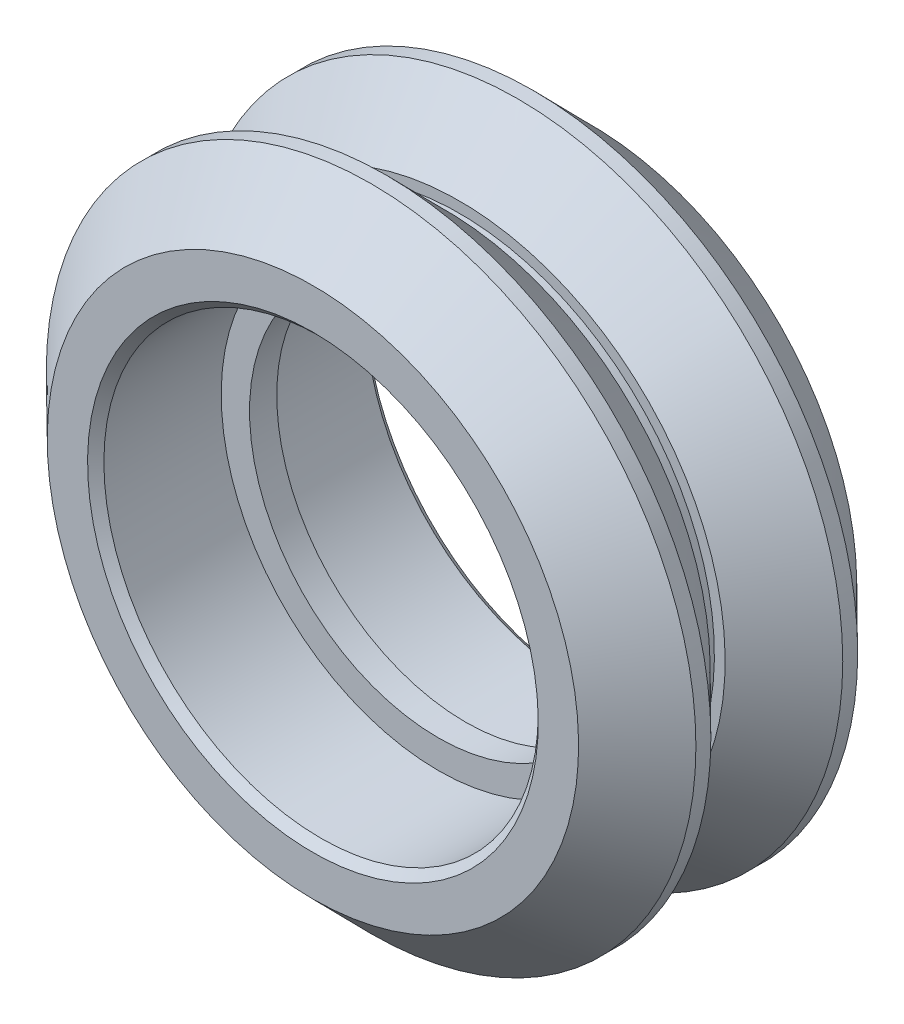
ISO-10303-21;
HEADER;
FILE_DESCRIPTION(('STEP AP214'),'2;1');
FILE_NAME('part.step','',(''),(''),'','','');
FILE_SCHEMA(('AUTOMOTIVE_DESIGN { 1 0 10303 214 1 1 1 1 }'));
ENDSEC;
DATA;
#1=APPLICATION_CONTEXT('core data for automotive mechanical design processes');
#2=APPLICATION_PROTOCOL_DEFINITION('international standard','automotive_design',2000,#1);
#3=PRODUCT_CONTEXT('',#1,'mechanical');
#4=PRODUCT('Part','Part','',(#3));
#5=PRODUCT_RELATED_PRODUCT_CATEGORY('part','',(#4));
#6=PRODUCT_DEFINITION_FORMATION('','',#4);
#7=PRODUCT_DEFINITION_CONTEXT('part definition',#1,'design');
#8=PRODUCT_DEFINITION('design','',#6,#7);
#9=PRODUCT_DEFINITION_SHAPE('','',#8);
#10=(LENGTH_UNIT() NAMED_UNIT(*) SI_UNIT(.MILLI.,.METRE.));
#11=(NAMED_UNIT(*) PLANE_ANGLE_UNIT() SI_UNIT($,.RADIAN.));
#12=(NAMED_UNIT(*) SI_UNIT($,.STERADIAN.) SOLID_ANGLE_UNIT());
#13=UNCERTAINTY_MEASURE_WITH_UNIT(LENGTH_MEASURE(1.E-05),#10,'distance_accuracy_value','');
#14=(GEOMETRIC_REPRESENTATION_CONTEXT(3) GLOBAL_UNCERTAINTY_ASSIGNED_CONTEXT((#13)) GLOBAL_UNIT_ASSIGNED_CONTEXT((#10,
#11,#12)) REPRESENTATION_CONTEXT('',''));
#15=CARTESIAN_POINT('',(0.,0.,0.));
#16=DIRECTION('',(0.,0.,1.));
#17=DIRECTION('',(1.,0.,0.));
#18=AXIS2_PLACEMENT_3D('',#15,#16,#17);
#19=CARTESIAN_POINT('',(0.,0.,5.115));
#20=DIRECTION('',(0.,0.,1.));
#21=DIRECTION('',(0.,-1.,0.));
#22=AXIS2_PLACEMENT_3D('',#19,#20,#21);
#23=CYLINDRICAL_SURFACE('',#22,7.987);
#24=CARTESIAN_POINT('',(0.,0.,4.815));
#25=DIRECTION('',(0.,0.,-1.));
#26=DIRECTION('',(0.,1.,0.));
#27=AXIS2_PLACEMENT_3D('',#24,#25,#26);
#28=CIRCLE('',#27,7.987);
#29=CARTESIAN_POINT('',(0.,7.987,4.815));
#30=VERTEX_POINT('',#29);
#31=EDGE_CURVE('E45',#30,#30,#28,.F.);
#32=ORIENTED_EDGE('',*,*,#31,.T.);
#33=EDGE_LOOP('',(#32));
#34=FACE_BOUND('',#33,.T.);
#35=CARTESIAN_POINT('',(0.,0.,0.499999999999998));
#36=DIRECTION('',(0.,0.,1.));
#37=DIRECTION('',(0.,-1.,0.));
#38=AXIS2_PLACEMENT_3D('',#35,#36,#37);
#39=CIRCLE('',#38,7.987);
#40=CARTESIAN_POINT('',(0.,-7.987,0.499999999999996));
#41=VERTEX_POINT('',#40);
#42=EDGE_CURVE('E89',#41,#41,#39,.T.);
#43=ORIENTED_EDGE('',*,*,#42,.F.);
#44=EDGE_LOOP('',(#43));
#45=FACE_BOUND('',#44,.T.);
#46=ADVANCED_FACE('F30',(#34,#45),#23,.F.);
#47=CARTESIAN_POINT('',(0.,9.77,5.115));
#48=DIRECTION('',(0.,0.,-1.));
#49=DIRECTION('',(0.,1.,0.));
#50=AXIS2_PLACEMENT_3D('',#47,#48,#49);
#51=PLANE('',#50);
#52=CARTESIAN_POINT('',(0.,0.,5.115));
#53=DIRECTION('',(0.,0.,-1.));
#54=DIRECTION('',(0.,1.,0.));
#55=AXIS2_PLACEMENT_3D('',#52,#53,#54);
#56=CIRCLE('',#55,8.287);
#57=CARTESIAN_POINT('',(0.,8.287,5.115));
#58=VERTEX_POINT('',#57);
#59=EDGE_CURVE('E41',#58,#58,#56,.T.);
#60=ORIENTED_EDGE('',*,*,#59,.T.);
#61=EDGE_LOOP('',(#60));
#62=FACE_BOUND('',#61,.T.);
#63=CARTESIAN_POINT('',(0.,0.,5.115));
#64=DIRECTION('',(0.,0.,1.));
#65=DIRECTION('',(0.,-1.,0.));
#66=AXIS2_PLACEMENT_3D('',#63,#64,#65);
#67=CIRCLE('',#66,9.77);
#68=CARTESIAN_POINT('',(0.,-9.77,5.115));
#69=VERTEX_POINT('',#68);
#70=EDGE_CURVE('E50',#69,#69,#67,.T.);
#71=ORIENTED_EDGE('',*,*,#70,.T.);
#72=EDGE_LOOP('',(#71));
#73=FACE_BOUND('',#72,.T.);
#74=ADVANCED_FACE('F96',(#62,#73),#51,.F.);
#75=CARTESIAN_POINT('',(0.,0.,2.975));
#76=DIRECTION('',(0.,0.,-1.));
#77=DIRECTION('',(0.,1.,0.));
#78=AXIS2_PLACEMENT_3D('',#75,#76,#77);
#79=CONICAL_SURFACE('',#78,11.945,0.79350922537995);
#80=ORIENTED_EDGE('',*,*,#70,.F.);
#81=EDGE_LOOP('',(#80));
#82=FACE_BOUND('',#81,.T.);
#83=CARTESIAN_POINT('',(0.,0.,2.975));
#84=DIRECTION('',(0.,0.,1.));
#85=DIRECTION('',(0.,-1.,0.));
#86=AXIS2_PLACEMENT_3D('',#83,#84,#85);
#87=CIRCLE('',#86,11.945);
#88=CARTESIAN_POINT('',(0.,-11.945,2.975));
#89=VERTEX_POINT('',#88);
#90=EDGE_CURVE('E53',#89,#89,#87,.T.);
#91=ORIENTED_EDGE('',*,*,#90,.T.);
#92=EDGE_LOOP('',(#91));
#93=FACE_BOUND('',#92,.T.);
#94=ADVANCED_FACE('F102',(#82,#93),#79,.T.);
#95=CARTESIAN_POINT('',(0.,0.,5.115));
#96=DIRECTION('',(0.,0.,1.));
#97=DIRECTION('',(0.,-1.,0.));
#98=AXIS2_PLACEMENT_3D('',#95,#96,#97);
#99=CYLINDRICAL_SURFACE('',#98,11.945);
#100=ORIENTED_EDGE('',*,*,#90,.F.);
#101=EDGE_LOOP('',(#100));
#102=FACE_BOUND('',#101,.T.);
#103=CARTESIAN_POINT('',(0.,0.,2.425));
#104=DIRECTION('',(0.,0.,1.));
#105=DIRECTION('',(0.,-1.,0.));
#106=AXIS2_PLACEMENT_3D('',#103,#104,#105);
#107=CIRCLE('',#106,11.945);
#108=CARTESIAN_POINT('',(0.,-11.945,2.425));
#109=VERTEX_POINT('',#108);
#110=EDGE_CURVE('E56',#109,#109,#107,.T.);
#111=ORIENTED_EDGE('',*,*,#110,.T.);
#112=EDGE_LOOP('',(#111));
#113=FACE_BOUND('',#112,.T.);
#114=ADVANCED_FACE('F125',(#102,#113),#99,.T.);
#115=CARTESIAN_POINT('',(0.,0.,0.274999999999998));
#116=DIRECTION('',(0.,0.,1.));
#117=DIRECTION('',(0.,-1.,0.));
#118=AXIS2_PLACEMENT_3D('',#115,#116,#117);
#119=CONICAL_SURFACE('',#118,9.77,0.791178445841111);
#120=ORIENTED_EDGE('',*,*,#110,.F.);
#121=EDGE_LOOP('',(#120));
#122=FACE_BOUND('',#121,.T.);
#123=CARTESIAN_POINT('',(0.,0.,0.274999999999998));
#124=DIRECTION('',(0.,0.,1.));
#125=DIRECTION('',(0.,-1.,0.));
#126=AXIS2_PLACEMENT_3D('',#123,#124,#125);
#127=CIRCLE('',#126,9.77);
#128=CARTESIAN_POINT('',(0.,-9.77,0.274999999999997));
#129=VERTEX_POINT('',#128);
#130=EDGE_CURVE('E59',#129,#129,#127,.T.);
#131=ORIENTED_EDGE('',*,*,#130,.T.);
#132=EDGE_LOOP('',(#131));
#133=FACE_BOUND('',#132,.T.);
#134=ADVANCED_FACE('F130',(#122,#133),#119,.T.);
#135=CARTESIAN_POINT('',(0.,9.77,0.275));
#136=DIRECTION('',(0.,0.,1.));
#137=DIRECTION('',(0.,-1.,0.));
#138=AXIS2_PLACEMENT_3D('',#135,#136,#137);
#139=PLANE('',#138);
#140=ORIENTED_EDGE('',*,*,#130,.F.);
#141=EDGE_LOOP('',(#140));
#142=FACE_BOUND('',#141,.T.);
#143=CARTESIAN_POINT('',(0.,0.,0.274999999999998));
#144=DIRECTION('',(0.,0.,1.));
#145=DIRECTION('',(0.,-1.,0.));
#146=AXIS2_PLACEMENT_3D('',#143,#144,#145);
#147=CIRCLE('',#146,9.375);
#148=CARTESIAN_POINT('',(0.,-9.375,0.274999999999997));
#149=VERTEX_POINT('',#148);
#150=EDGE_CURVE('E62',#149,#149,#147,.T.);
#151=ORIENTED_EDGE('',*,*,#150,.T.);
#152=EDGE_LOOP('',(#151));
#153=FACE_BOUND('',#152,.T.);
#154=ADVANCED_FACE('F136',(#142,#153),#139,.F.);
#155=CARTESIAN_POINT('',(0.,0.,5.115));
#156=DIRECTION('',(0.,0.,1.));
#157=DIRECTION('',(0.,-1.,0.));
#158=AXIS2_PLACEMENT_3D('',#155,#156,#157);
#159=CYLINDRICAL_SURFACE('',#158,9.375);
#160=ORIENTED_EDGE('',*,*,#150,.F.);
#161=EDGE_LOOP('',(#160));
#162=FACE_BOUND('',#161,.T.);
#163=CARTESIAN_POINT('',(0.,0.,-0.275000000000002));
#164=DIRECTION('',(0.,0.,1.));
#165=DIRECTION('',(0.,-1.,0.));
#166=AXIS2_PLACEMENT_3D('',#163,#164,#165);
#167=CIRCLE('',#166,9.375);
#168=CARTESIAN_POINT('',(0.,-9.375,-0.275000000000004));
#169=VERTEX_POINT('',#168);
#170=EDGE_CURVE('E65',#169,#169,#167,.T.);
#171=ORIENTED_EDGE('',*,*,#170,.T.);
#172=EDGE_LOOP('',(#171));
#173=FACE_BOUND('',#172,.T.);
#174=ADVANCED_FACE('F142',(#162,#173),#159,.T.);
#175=CARTESIAN_POINT('',(0.,9.77,-0.275));
#176=DIRECTION('',(0.,0.,-1.));
#177=DIRECTION('',(0.,1.,0.));
#178=AXIS2_PLACEMENT_3D('',#175,#176,#177);
#179=PLANE('',#178);
#180=ORIENTED_EDGE('',*,*,#170,.F.);
#181=EDGE_LOOP('',(#180));
#182=FACE_BOUND('',#181,.T.);
#183=CARTESIAN_POINT('',(0.,0.,-0.275000000000002));
#184=DIRECTION('',(0.,0.,1.));
#185=DIRECTION('',(0.,-1.,0.));
#186=AXIS2_PLACEMENT_3D('',#183,#184,#185);
#187=CIRCLE('',#186,9.77);
#188=CARTESIAN_POINT('',(0.,-9.77,-0.275000000000004));
#189=VERTEX_POINT('',#188);
#190=EDGE_CURVE('E68',#189,#189,#187,.T.);
#191=ORIENTED_EDGE('',*,*,#190,.T.);
#192=EDGE_LOOP('',(#191));
#193=FACE_BOUND('',#192,.T.);
#194=ADVANCED_FACE('F148',(#182,#193),#179,.F.);
#195=CARTESIAN_POINT('',(0.,0.,-2.425));
#196=DIRECTION('',(0.,0.,-1.));
#197=DIRECTION('',(0.,1.,0.));
#198=AXIS2_PLACEMENT_3D('',#195,#196,#197);
#199=CONICAL_SURFACE('',#198,11.945,0.791178445841111);
#200=ORIENTED_EDGE('',*,*,#190,.F.);
#201=EDGE_LOOP('',(#200));
#202=FACE_BOUND('',#201,.T.);
#203=CARTESIAN_POINT('',(0.,0.,-2.425));
#204=DIRECTION('',(0.,0.,1.));
#205=DIRECTION('',(0.,-1.,0.));
#206=AXIS2_PLACEMENT_3D('',#203,#204,#205);
#207=CIRCLE('',#206,11.945);
#208=CARTESIAN_POINT('',(0.,-11.945,-2.425));
#209=VERTEX_POINT('',#208);
#210=EDGE_CURVE('E71',#209,#209,#207,.T.);
#211=ORIENTED_EDGE('',*,*,#210,.T.);
#212=EDGE_LOOP('',(#211));
#213=FACE_BOUND('',#212,.T.);
#214=ADVANCED_FACE('F154',(#202,#213),#199,.T.);
#215=CARTESIAN_POINT('',(0.,0.,5.115));
#216=DIRECTION('',(0.,0.,1.));
#217=DIRECTION('',(0.,-1.,0.));
#218=AXIS2_PLACEMENT_3D('',#215,#216,#217);
#219=CYLINDRICAL_SURFACE('',#218,11.945);
#220=ORIENTED_EDGE('',*,*,#210,.F.);
#221=EDGE_LOOP('',(#220));
#222=FACE_BOUND('',#221,.T.);
#223=CARTESIAN_POINT('',(0.,0.,-2.975));
#224=DIRECTION('',(0.,0.,1.));
#225=DIRECTION('',(0.,-1.,0.));
#226=AXIS2_PLACEMENT_3D('',#223,#224,#225);
#227=CIRCLE('',#226,11.945);
#228=CARTESIAN_POINT('',(0.,-11.945,-2.975));
#229=VERTEX_POINT('',#228);
#230=EDGE_CURVE('E74',#229,#229,#227,.T.);
#231=ORIENTED_EDGE('',*,*,#230,.T.);
#232=EDGE_LOOP('',(#231));
#233=FACE_BOUND('',#232,.T.);
#234=ADVANCED_FACE('F160',(#222,#233),#219,.T.);
#235=CARTESIAN_POINT('',(0.,0.,-5.115));
#236=DIRECTION('',(0.,0.,1.));
#237=DIRECTION('',(0.,-1.,0.));
#238=AXIS2_PLACEMENT_3D('',#235,#236,#237);
#239=CONICAL_SURFACE('',#238,9.77,0.79350922537995);
#240=ORIENTED_EDGE('',*,*,#230,.F.);
#241=EDGE_LOOP('',(#240));
#242=FACE_BOUND('',#241,.T.);
#243=CARTESIAN_POINT('',(0.,0.,-5.115));
#244=DIRECTION('',(0.,0.,1.));
#245=DIRECTION('',(0.,-1.,0.));
#246=AXIS2_PLACEMENT_3D('',#243,#244,#245);
#247=CIRCLE('',#246,9.77);
#248=CARTESIAN_POINT('',(0.,-9.77,-5.115));
#249=VERTEX_POINT('',#248);
#250=EDGE_CURVE('E77',#249,#249,#247,.T.);
#251=ORIENTED_EDGE('',*,*,#250,.T.);
#252=EDGE_LOOP('',(#251));
#253=FACE_BOUND('',#252,.T.);
#254=ADVANCED_FACE('F166',(#242,#253),#239,.T.);
#255=CARTESIAN_POINT('',(0.,9.77,-5.115));
#256=DIRECTION('',(0.,0.,1.));
#257=DIRECTION('',(0.,-1.,0.));
#258=AXIS2_PLACEMENT_3D('',#255,#256,#257);
#259=PLANE('',#258);
#260=CARTESIAN_POINT('',(0.,0.,-5.115));
#261=DIRECTION('',(0.,0.,1.));
#262=DIRECTION('',(0.,-1.,0.));
#263=AXIS2_PLACEMENT_3D('',#260,#261,#262);
#264=CIRCLE('',#263,8.28700000000001);
#265=CARTESIAN_POINT('',(0.,-8.287,-5.115));
#266=VERTEX_POINT('',#265);
#267=EDGE_CURVE('E37',#266,#266,#264,.T.);
#268=ORIENTED_EDGE('',*,*,#267,.T.);
#269=EDGE_LOOP('',(#268));
#270=FACE_BOUND('',#269,.T.);
#271=ORIENTED_EDGE('',*,*,#250,.F.);
#272=EDGE_LOOP('',(#271));
#273=FACE_BOUND('',#272,.T.);
#274=ADVANCED_FACE('F172',(#270,#273),#259,.F.);
#275=CARTESIAN_POINT('',(0.,0.,5.115));
#276=DIRECTION('',(0.,0.,1.));
#277=DIRECTION('',(0.,-1.,0.));
#278=AXIS2_PLACEMENT_3D('',#275,#276,#277);
#279=CYLINDRICAL_SURFACE('',#278,7.987);
#280=CARTESIAN_POINT('',(0.,0.,-4.815));
#281=DIRECTION('',(0.,0.,1.));
#282=DIRECTION('',(0.,-1.,0.));
#283=AXIS2_PLACEMENT_3D('',#280,#281,#282);
#284=CIRCLE('',#283,7.987);
#285=CARTESIAN_POINT('',(0.,-7.987,-4.815));
#286=VERTEX_POINT('',#285);
#287=EDGE_CURVE('E10',#286,#286,#284,.F.);
#288=ORIENTED_EDGE('',*,*,#287,.T.);
#289=EDGE_LOOP('',(#288));
#290=FACE_BOUND('',#289,.T.);
#291=CARTESIAN_POINT('',(0.,0.,-0.500000000000001));
#292=DIRECTION('',(0.,0.,1.));
#293=DIRECTION('',(0.,-1.,0.));
#294=AXIS2_PLACEMENT_3D('',#291,#292,#293);
#295=CIRCLE('',#294,7.987);
#296=CARTESIAN_POINT('',(0.,-7.987,-0.500000000000003));
#297=VERTEX_POINT('',#296);
#298=EDGE_CURVE('E80',#297,#297,#295,.T.);
#299=ORIENTED_EDGE('',*,*,#298,.T.);
#300=EDGE_LOOP('',(#299));
#301=FACE_BOUND('',#300,.T.);
#302=ADVANCED_FACE('F177',(#290,#301),#279,.F.);
#303=CARTESIAN_POINT('',(0.,7.987,-0.5));
#304=DIRECTION('',(0.,0.,1.));
#305=DIRECTION('',(0.,-1.,0.));
#306=AXIS2_PLACEMENT_3D('',#303,#304,#305);
#307=PLANE('',#306);
#308=ORIENTED_EDGE('',*,*,#298,.F.);
#309=EDGE_LOOP('',(#308));
#310=FACE_BOUND('',#309,.T.);
#311=CARTESIAN_POINT('',(0.,0.,-0.500000000000002));
#312=DIRECTION('',(0.,0.,1.));
#313=DIRECTION('',(0.,-1.,0.));
#314=AXIS2_PLACEMENT_3D('',#311,#312,#313);
#315=CIRCLE('',#314,6.945);
#316=CARTESIAN_POINT('',(0.,-6.945,-0.500000000000003));
#317=VERTEX_POINT('',#316);
#318=EDGE_CURVE('E83',#317,#317,#315,.T.);
#319=ORIENTED_EDGE('',*,*,#318,.T.);
#320=EDGE_LOOP('',(#319));
#321=FACE_BOUND('',#320,.T.);
#322=ADVANCED_FACE('F182',(#310,#321),#307,.F.);
#323=CARTESIAN_POINT('',(0.,0.,5.115));
#324=DIRECTION('',(0.,0.,1.));
#325=DIRECTION('',(0.,-1.,0.));
#326=AXIS2_PLACEMENT_3D('',#323,#324,#325);
#327=CYLINDRICAL_SURFACE('',#326,6.945);
#328=ORIENTED_EDGE('',*,*,#318,.F.);
#329=EDGE_LOOP('',(#328));
#330=FACE_BOUND('',#329,.T.);
#331=CARTESIAN_POINT('',(0.,0.,0.499999999999999));
#332=DIRECTION('',(0.,0.,1.));
#333=DIRECTION('',(0.,-1.,0.));
#334=AXIS2_PLACEMENT_3D('',#331,#332,#333);
#335=CIRCLE('',#334,6.945);
#336=CARTESIAN_POINT('',(0.,-6.945,0.499999999999997));
#337=VERTEX_POINT('',#336);
#338=EDGE_CURVE('E86',#337,#337,#335,.T.);
#339=ORIENTED_EDGE('',*,*,#338,.T.);
#340=EDGE_LOOP('',(#339));
#341=FACE_BOUND('',#340,.T.);
#342=ADVANCED_FACE('F114',(#330,#341),#327,.F.);
#343=CARTESIAN_POINT('',(0.,7.987,0.5));
#344=DIRECTION('',(0.,0.,-1.));
#345=DIRECTION('',(0.,1.,0.));
#346=AXIS2_PLACEMENT_3D('',#343,#344,#345);
#347=PLANE('',#346);
#348=ORIENTED_EDGE('',*,*,#338,.F.);
#349=EDGE_LOOP('',(#348));
#350=FACE_BOUND('',#349,.T.);
#351=ORIENTED_EDGE('',*,*,#42,.T.);
#352=EDGE_LOOP('',(#351));
#353=FACE_BOUND('',#352,.T.);
#354=ADVANCED_FACE('F93',(#350,#353),#347,.F.);
#355=CARTESIAN_POINT('',(0.,0.,4.815));
#356=DIRECTION('',(0.,0.,1.));
#357=DIRECTION('',(0.,-1.,0.));
#358=AXIS2_PLACEMENT_3D('',#355,#356,#357);
#359=CONICAL_SURFACE('',#358,7.987,0.78539816339746);
#360=ORIENTED_EDGE('',*,*,#59,.F.);
#361=EDGE_LOOP('',(#360));
#362=FACE_BOUND('',#361,.T.);
#363=ORIENTED_EDGE('',*,*,#31,.F.);
#364=EDGE_LOOP('',(#363));
#365=FACE_BOUND('',#364,.T.);
#366=ADVANCED_FACE('F106',(#362,#365),#359,.F.);
#367=CARTESIAN_POINT('',(0.,0.,-5.115));
#368=DIRECTION('',(0.,0.,-1.));
#369=DIRECTION('',(0.,1.,0.));
#370=AXIS2_PLACEMENT_3D('',#367,#368,#369);
#371=CONICAL_SURFACE('',#370,8.28700000000001,0.785398163397448);
#372=ORIENTED_EDGE('',*,*,#287,.F.);
#373=EDGE_LOOP('',(#372));
#374=FACE_BOUND('',#373,.T.);
#375=ORIENTED_EDGE('',*,*,#267,.F.);
#376=EDGE_LOOP('',(#375));
#377=FACE_BOUND('',#376,.T.);
#378=ADVANCED_FACE('F32',(#374,#377),#371,.F.);
#379=CLOSED_SHELL('',(#46,#74,#94,#114,#134,#154,#174,#194,#214,#234,#254,#274,#302,#322,#342,
#354,#366,#378));
#380=MANIFOLD_SOLID_BREP('B2',#379);
#381=ADVANCED_BREP_SHAPE_REPRESENTATION('',(#18,#380),#14);
#382=SHAPE_DEFINITION_REPRESENTATION(#9,#381);
ENDSEC;
END-ISO-10303-21;
